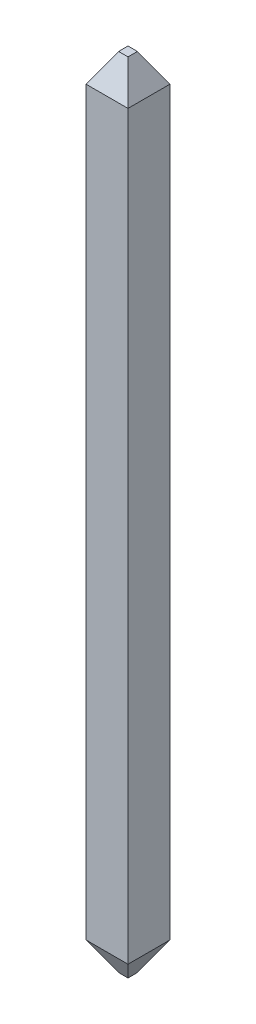
ISO-10303-21;
HEADER;
FILE_DESCRIPTION(('STEP AP214'),'2;1');
FILE_NAME('part.step','',(''),(''),'','','');
FILE_SCHEMA(('AUTOMOTIVE_DESIGN { 1 0 10303 214 1 1 1 1 }'));
ENDSEC;
DATA;
#1=APPLICATION_CONTEXT('core data for automotive mechanical design processes');
#2=APPLICATION_PROTOCOL_DEFINITION('international standard','automotive_design',2000,#1);
#3=PRODUCT_CONTEXT('',#1,'mechanical');
#4=PRODUCT('Part','Part','',(#3));
#5=PRODUCT_RELATED_PRODUCT_CATEGORY('part','',(#4));
#6=PRODUCT_DEFINITION_FORMATION('','',#4);
#7=PRODUCT_DEFINITION_CONTEXT('part definition',#1,'design');
#8=PRODUCT_DEFINITION('design','',#6,#7);
#9=PRODUCT_DEFINITION_SHAPE('','',#8);
#10=(LENGTH_UNIT() NAMED_UNIT(*) SI_UNIT(.MILLI.,.METRE.));
#11=(NAMED_UNIT(*) PLANE_ANGLE_UNIT() SI_UNIT($,.RADIAN.));
#12=(NAMED_UNIT(*) SI_UNIT($,.STERADIAN.) SOLID_ANGLE_UNIT());
#13=UNCERTAINTY_MEASURE_WITH_UNIT(LENGTH_MEASURE(1.E-05),#10,'distance_accuracy_value','');
#14=(GEOMETRIC_REPRESENTATION_CONTEXT(3) GLOBAL_UNCERTAINTY_ASSIGNED_CONTEXT((#13)) GLOBAL_UNIT_ASSIGNED_CONTEXT((#10,
#11,#12)) REPRESENTATION_CONTEXT('',''));
#15=CARTESIAN_POINT('',(0.,0.,0.));
#16=DIRECTION('',(0.,0.,1.));
#17=DIRECTION('',(1.,0.,0.));
#18=AXIS2_PLACEMENT_3D('',#15,#16,#17);
#19=CARTESIAN_POINT('',(-0.075,12.7,0.));
#20=DIRECTION('',(-0.866025403784436,0.5,0.));
#21=DIRECTION('',(0.,0.,1.));
#22=AXIS2_PLACEMENT_3D('',#19,#20,#21);
#23=PLANE('',#22);
#24=DIRECTION('',(-0.447213595499961,-0.774596669241479,0.447213595499962));
#25=VECTOR('',#24,1.);
#26=CARTESIAN_POINT('',(-0.075,12.7,0.0749999999999992));
#27=LINE('',#26,#25);
#28=CARTESIAN_POINT('',(-0.075,12.7,0.0749999999999992));
#29=VERTEX_POINT('',#28);
#30=CARTESIAN_POINT('',(-0.335,12.2496667900321,0.335));
#31=VERTEX_POINT('',#30);
#32=EDGE_CURVE('E196',#29,#31,#27,.T.);
#33=ORIENTED_EDGE('',*,*,#32,.F.);
#34=DIRECTION('',(0.,0.,1.));
#35=VECTOR('',#34,1.);
#36=CARTESIAN_POINT('',(-0.075,12.7,0.));
#37=LINE('',#36,#35);
#38=CARTESIAN_POINT('',(-0.075,12.7,-0.075));
#39=VERTEX_POINT('',#38);
#40=EDGE_CURVE('E11',#39,#29,#37,.T.);
#41=ORIENTED_EDGE('',*,*,#40,.F.);
#42=DIRECTION('',(0.447213595499962,0.774596669241479,0.447213595499962));
#43=VECTOR('',#42,1.);
#44=CARTESIAN_POINT('',(-0.335,12.2496667900321,-0.335));
#45=LINE('',#44,#43);
#46=CARTESIAN_POINT('',(-0.335,12.2496667900321,-0.335));
#47=VERTEX_POINT('',#46);
#48=EDGE_CURVE('E109',#47,#39,#45,.T.);
#49=ORIENTED_EDGE('',*,*,#48,.F.);
#50=DIRECTION('',(0.,0.,1.));
#51=VECTOR('',#50,1.);
#52=CARTESIAN_POINT('',(-0.335,12.2496667900321,-0.335));
#53=LINE('',#52,#51);
#54=EDGE_CURVE('E176',#47,#31,#53,.T.);
#55=ORIENTED_EDGE('',*,*,#54,.T.);
#56=EDGE_LOOP('',(#33,#41,#49,#55));
#57=FACE_BOUND('',#56,.T.);
#58=ADVANCED_FACE('F16',(#57),#23,.T.);
#59=CARTESIAN_POINT('',(-0.335,0.45033320996791,-0.335));
#60=DIRECTION('',(0.866025403784439,0.5,0.));
#61=DIRECTION('',(0.,0.,-1.));
#62=AXIS2_PLACEMENT_3D('',#59,#60,#61);
#63=PLANE('',#62);
#64=DIRECTION('',(0.,0.,-1.));
#65=VECTOR('',#64,1.);
#66=CARTESIAN_POINT('',(-0.335,0.45033320996791,-0.335));
#67=LINE('',#66,#65);
#68=CARTESIAN_POINT('',(-0.335,0.45033320996791,0.335));
#69=VERTEX_POINT('',#68);
#70=CARTESIAN_POINT('',(-0.335,0.45033320996791,-0.335));
#71=VERTEX_POINT('',#70);
#72=EDGE_CURVE('E117',#69,#71,#67,.T.);
#73=ORIENTED_EDGE('',*,*,#72,.T.);
#74=DIRECTION('',(0.447213595499958,-0.774596669241484,0.447213595499957));
#75=VECTOR('',#74,1.);
#76=CARTESIAN_POINT('',(-0.335,0.45033320996791,-0.335));
#77=LINE('',#76,#75);
#78=CARTESIAN_POINT('',(-0.075,0.,-0.075));
#79=VERTEX_POINT('',#78);
#80=EDGE_CURVE('E190',#71,#79,#77,.T.);
#81=ORIENTED_EDGE('',*,*,#80,.T.);
#82=DIRECTION('',(0.,0.,1.));
#83=VECTOR('',#82,1.);
#84=CARTESIAN_POINT('',(-0.075,0.,0.));
#85=LINE('',#84,#83);
#86=CARTESIAN_POINT('',(-0.075,0.,0.0749999999999992));
#87=VERTEX_POINT('',#86);
#88=EDGE_CURVE('E192',#79,#87,#85,.T.);
#89=ORIENTED_EDGE('',*,*,#88,.T.);
#90=DIRECTION('',(-0.447213595499957,0.774596669241484,0.447213595499957));
#91=VECTOR('',#90,1.);
#92=CARTESIAN_POINT('',(-0.075,0.,0.0749999999999992));
#93=LINE('',#92,#91);
#94=EDGE_CURVE('E136',#87,#69,#93,.T.);
#95=ORIENTED_EDGE('',*,*,#94,.T.);
#96=EDGE_LOOP('',(#73,#81,#89,#95));
#97=FACE_BOUND('',#96,.T.);
#98=ADVANCED_FACE('F238',(#97),#63,.F.);
#99=CARTESIAN_POINT('',(0.,12.7,0.));
#100=DIRECTION('',(0.,1.,0.));
#101=DIRECTION('',(1.,0.,0.));
#102=AXIS2_PLACEMENT_3D('',#99,#100,#101);
#103=PLANE('',#102);
#104=DIRECTION('',(0.,0.,1.));
#105=VECTOR('',#104,1.);
#106=CARTESIAN_POINT('',(0.075,12.7,0.));
#107=LINE('',#106,#105);
#108=CARTESIAN_POINT('',(0.075,12.7,-0.075));
#109=VERTEX_POINT('',#108);
#110=CARTESIAN_POINT('',(0.075,12.7,0.0749999999999992));
#111=VERTEX_POINT('',#110);
#112=EDGE_CURVE('E113',#109,#111,#107,.T.);
#113=ORIENTED_EDGE('',*,*,#112,.F.);
#114=DIRECTION('',(1.,0.,0.));
#115=VECTOR('',#114,1.);
#116=CARTESIAN_POINT('',(0.,12.7,-0.075));
#117=LINE('',#116,#115);
#118=EDGE_CURVE('E26',#39,#109,#117,.T.);
#119=ORIENTED_EDGE('',*,*,#118,.F.);
#120=ORIENTED_EDGE('',*,*,#40,.T.);
#121=DIRECTION('',(-1.,0.,0.));
#122=VECTOR('',#121,1.);
#123=CARTESIAN_POINT('',(0.,12.7,0.0749999999999992));
#124=LINE('',#123,#122);
#125=EDGE_CURVE('E115',#111,#29,#124,.T.);
#126=ORIENTED_EDGE('',*,*,#125,.F.);
#127=EDGE_LOOP('',(#113,#119,#120,#126));
#128=FACE_BOUND('',#127,.T.);
#129=ADVANCED_FACE('F18',(#128),#103,.T.);
#130=CARTESIAN_POINT('',(0.,12.7,-0.075));
#131=DIRECTION('',(0.,0.5,-0.866025403784436));
#132=DIRECTION('',(-1.,0.,0.));
#133=AXIS2_PLACEMENT_3D('',#130,#131,#132);
#134=PLANE('',#133);
#135=ORIENTED_EDGE('',*,*,#48,.T.);
#136=ORIENTED_EDGE('',*,*,#118,.T.);
#137=DIRECTION('',(-0.447213595499962,0.774596669241479,0.447213595499962));
#138=VECTOR('',#137,1.);
#139=CARTESIAN_POINT('',(0.335,12.2496667900321,-0.335));
#140=LINE('',#139,#138);
#141=CARTESIAN_POINT('',(0.335,12.2496667900321,-0.335));
#142=VERTEX_POINT('',#141);
#143=EDGE_CURVE('E101',#142,#109,#140,.T.);
#144=ORIENTED_EDGE('',*,*,#143,.F.);
#145=DIRECTION('',(-1.,0.,0.));
#146=VECTOR('',#145,1.);
#147=CARTESIAN_POINT('',(-0.335,12.2496667900321,-0.335));
#148=LINE('',#147,#146);
#149=EDGE_CURVE('E130',#142,#47,#148,.T.);
#150=ORIENTED_EDGE('',*,*,#149,.T.);
#151=EDGE_LOOP('',(#135,#136,#144,#150));
#152=FACE_BOUND('',#151,.T.);
#153=ADVANCED_FACE('F108',(#152),#134,.T.);
#154=CARTESIAN_POINT('',(-0.335,0.45033320996791,-0.335));
#155=DIRECTION('',(0.,0.5,0.866025403784439));
#156=DIRECTION('',(1.,0.,0.));
#157=AXIS2_PLACEMENT_3D('',#154,#155,#156);
#158=PLANE('',#157);
#159=DIRECTION('',(-1.,0.,0.));
#160=VECTOR('',#159,1.);
#161=CARTESIAN_POINT('',(0.,0.,-0.075));
#162=LINE('',#161,#160);
#163=CARTESIAN_POINT('',(0.075,0.,-0.075));
#164=VERTEX_POINT('',#163);
#165=EDGE_CURVE('E199',#164,#79,#162,.T.);
#166=ORIENTED_EDGE('',*,*,#165,.T.);
#167=ORIENTED_EDGE('',*,*,#80,.F.);
#168=DIRECTION('',(1.,0.,0.));
#169=VECTOR('',#168,1.);
#170=CARTESIAN_POINT('',(-0.335,0.45033320996791,-0.335));
#171=LINE('',#170,#169);
#172=CARTESIAN_POINT('',(0.335,0.45033320996791,-0.335));
#173=VERTEX_POINT('',#172);
#174=EDGE_CURVE('E189',#71,#173,#171,.T.);
#175=ORIENTED_EDGE('',*,*,#174,.T.);
#176=DIRECTION('',(-0.447213595499957,-0.774596669241484,0.447213595499957));
#177=VECTOR('',#176,1.);
#178=CARTESIAN_POINT('',(0.335,0.45033320996791,-0.335));
#179=LINE('',#178,#177);
#180=EDGE_CURVE('E148',#173,#164,#179,.T.);
#181=ORIENTED_EDGE('',*,*,#180,.T.);
#182=EDGE_LOOP('',(#166,#167,#175,#181));
#183=FACE_BOUND('',#182,.T.);
#184=ADVANCED_FACE('F235',(#183),#158,.F.);
#185=CARTESIAN_POINT('',(0.,0.,0.));
#186=DIRECTION('',(0.,1.,0.));
#187=DIRECTION('',(1.,0.,0.));
#188=AXIS2_PLACEMENT_3D('',#185,#186,#187);
#189=PLANE('',#188);
#190=ORIENTED_EDGE('',*,*,#165,.F.);
#191=DIRECTION('',(0.,0.,1.));
#192=VECTOR('',#191,1.);
#193=CARTESIAN_POINT('',(0.0749999999999992,0.,-0.335));
#194=LINE('',#193,#192);
#195=CARTESIAN_POINT('',(0.075,0.,0.0749999999999992));
#196=VERTEX_POINT('',#195);
#197=EDGE_CURVE('E146',#164,#196,#194,.T.);
#198=ORIENTED_EDGE('',*,*,#197,.T.);
#199=DIRECTION('',(-1.,0.,0.));
#200=VECTOR('',#199,1.);
#201=CARTESIAN_POINT('',(-0.335,0.,0.0749999999999992));
#202=LINE('',#201,#200);
#203=EDGE_CURVE('E138',#196,#87,#202,.T.);
#204=ORIENTED_EDGE('',*,*,#203,.T.);
#205=ORIENTED_EDGE('',*,*,#88,.F.);
#206=EDGE_LOOP('',(#190,#198,#204,#205));
#207=FACE_BOUND('',#206,.T.);
#208=ADVANCED_FACE('F209',(#207),#189,.F.);
#209=CARTESIAN_POINT('',(0.,12.7,0.0749999999999992));
#210=DIRECTION('',(0.,0.5,0.866025403784436));
#211=DIRECTION('',(1.,0.,0.));
#212=AXIS2_PLACEMENT_3D('',#209,#210,#211);
#213=PLANE('',#212);
#214=DIRECTION('',(0.447213595499962,-0.774596669241479,0.447213595499962));
#215=VECTOR('',#214,1.);
#216=CARTESIAN_POINT('',(0.075,12.7,0.0749999999999992));
#217=LINE('',#216,#215);
#218=CARTESIAN_POINT('',(0.335,12.2496667900321,0.335));
#219=VERTEX_POINT('',#218);
#220=EDGE_CURVE('E86',#111,#219,#217,.T.);
#221=ORIENTED_EDGE('',*,*,#220,.F.);
#222=ORIENTED_EDGE('',*,*,#125,.T.);
#223=ORIENTED_EDGE('',*,*,#32,.T.);
#224=DIRECTION('',(1.,0.,0.));
#225=VECTOR('',#224,1.);
#226=CARTESIAN_POINT('',(-0.335,12.2496667900321,0.335));
#227=LINE('',#226,#225);
#228=EDGE_CURVE('E139',#31,#219,#227,.T.);
#229=ORIENTED_EDGE('',*,*,#228,.T.);
#230=EDGE_LOOP('',(#221,#222,#223,#229));
#231=FACE_BOUND('',#230,.T.);
#232=ADVANCED_FACE('F299',(#231),#213,.T.);
#233=CARTESIAN_POINT('',(-0.335,0.45033320996791,0.335));
#234=DIRECTION('',(0.,0.5,-0.866025403784439));
#235=DIRECTION('',(-1.,0.,0.));
#236=AXIS2_PLACEMENT_3D('',#233,#234,#235);
#237=PLANE('',#236);
#238=ORIENTED_EDGE('',*,*,#203,.F.);
#239=DIRECTION('',(0.447213595499958,0.774596669241484,0.447213595499957));
#240=VECTOR('',#239,1.);
#241=CARTESIAN_POINT('',(0.075,0.,0.0749999999999992));
#242=LINE('',#241,#240);
#243=CARTESIAN_POINT('',(0.335,0.45033320996791,0.335));
#244=VERTEX_POINT('',#243);
#245=EDGE_CURVE('E151',#196,#244,#242,.T.);
#246=ORIENTED_EDGE('',*,*,#245,.T.);
#247=DIRECTION('',(-1.,0.,0.));
#248=VECTOR('',#247,1.);
#249=CARTESIAN_POINT('',(-0.335,0.45033320996791,0.335));
#250=LINE('',#249,#248);
#251=EDGE_CURVE('E143',#244,#69,#250,.T.);
#252=ORIENTED_EDGE('',*,*,#251,.T.);
#253=ORIENTED_EDGE('',*,*,#94,.F.);
#254=EDGE_LOOP('',(#238,#246,#252,#253));
#255=FACE_BOUND('',#254,.T.);
#256=ADVANCED_FACE('F215',(#255),#237,.F.);
#257=CARTESIAN_POINT('',(-0.335,12.7,-0.335));
#258=DIRECTION('',(1.,0.,0.));
#259=DIRECTION('',(0.,0.,-1.));
#260=AXIS2_PLACEMENT_3D('',#257,#258,#259);
#261=PLANE('',#260);
#262=ORIENTED_EDGE('',*,*,#72,.F.);
#263=DIRECTION('',(0.,1.,0.));
#264=VECTOR('',#263,1.);
#265=CARTESIAN_POINT('',(-0.335,12.7,0.335));
#266=LINE('',#265,#264);
#267=EDGE_CURVE('E142',#69,#31,#266,.T.);
#268=ORIENTED_EDGE('',*,*,#267,.T.);
#269=ORIENTED_EDGE('',*,*,#54,.F.);
#270=DIRECTION('',(0.,-1.,0.));
#271=VECTOR('',#270,1.);
#272=CARTESIAN_POINT('',(-0.335,12.7,-0.335));
#273=LINE('',#272,#271);
#274=EDGE_CURVE('E134',#47,#71,#273,.T.);
#275=ORIENTED_EDGE('',*,*,#274,.T.);
#276=EDGE_LOOP('',(#262,#268,#269,#275));
#277=FACE_BOUND('',#276,.T.);
#278=ADVANCED_FACE('F241',(#277),#261,.F.);
#279=CARTESIAN_POINT('',(0.075,12.7,0.));
#280=DIRECTION('',(0.866025403784436,0.5,0.));
#281=DIRECTION('',(0.,0.,-1.));
#282=AXIS2_PLACEMENT_3D('',#279,#280,#281);
#283=PLANE('',#282);
#284=ORIENTED_EDGE('',*,*,#220,.T.);
#285=DIRECTION('',(0.,0.,-1.));
#286=VECTOR('',#285,1.);
#287=CARTESIAN_POINT('',(0.335,12.2496667900321,-0.335));
#288=LINE('',#287,#286);
#289=EDGE_CURVE('E121',#219,#142,#288,.T.);
#290=ORIENTED_EDGE('',*,*,#289,.T.);
#291=ORIENTED_EDGE('',*,*,#143,.T.);
#292=ORIENTED_EDGE('',*,*,#112,.T.);
#293=EDGE_LOOP('',(#284,#290,#291,#292));
#294=FACE_BOUND('',#293,.T.);
#295=ADVANCED_FACE('F119',(#294),#283,.T.);
#296=CARTESIAN_POINT('',(-0.335,12.7,-0.335));
#297=DIRECTION('',(0.,0.,1.));
#298=DIRECTION('',(1.,0.,0.));
#299=AXIS2_PLACEMENT_3D('',#296,#297,#298);
#300=PLANE('',#299);
#301=ORIENTED_EDGE('',*,*,#174,.F.);
#302=ORIENTED_EDGE('',*,*,#274,.F.);
#303=ORIENTED_EDGE('',*,*,#149,.F.);
#304=DIRECTION('',(0.,-1.,0.));
#305=VECTOR('',#304,1.);
#306=CARTESIAN_POINT('',(0.335,12.7,-0.335));
#307=LINE('',#306,#305);
#308=EDGE_CURVE('E165',#142,#173,#307,.T.);
#309=ORIENTED_EDGE('',*,*,#308,.T.);
#310=EDGE_LOOP('',(#301,#302,#303,#309));
#311=FACE_BOUND('',#310,.T.);
#312=ADVANCED_FACE('F224',(#311),#300,.F.);
#313=CARTESIAN_POINT('',(0.335,0.45033320996791,-0.335));
#314=DIRECTION('',(-0.866025403784439,0.5,0.));
#315=DIRECTION('',(0.,0.,1.));
#316=AXIS2_PLACEMENT_3D('',#313,#314,#315);
#317=PLANE('',#316);
#318=ORIENTED_EDGE('',*,*,#197,.F.);
#319=ORIENTED_EDGE('',*,*,#180,.F.);
#320=DIRECTION('',(0.,0.,1.));
#321=VECTOR('',#320,1.);
#322=CARTESIAN_POINT('',(0.335,0.45033320996791,-0.335));
#323=LINE('',#322,#321);
#324=EDGE_CURVE('E172',#173,#244,#323,.T.);
#325=ORIENTED_EDGE('',*,*,#324,.T.);
#326=ORIENTED_EDGE('',*,*,#245,.F.);
#327=EDGE_LOOP('',(#318,#319,#325,#326));
#328=FACE_BOUND('',#327,.T.);
#329=ADVANCED_FACE('F217',(#328),#317,.F.);
#330=CARTESIAN_POINT('',(-0.335,12.7,0.335));
#331=DIRECTION('',(0.,0.,-1.));
#332=DIRECTION('',(0.,-1.,0.));
#333=AXIS2_PLACEMENT_3D('',#330,#331,#332);
#334=PLANE('',#333);
#335=ORIENTED_EDGE('',*,*,#251,.F.);
#336=DIRECTION('',(0.,1.,0.));
#337=VECTOR('',#336,1.);
#338=CARTESIAN_POINT('',(0.335,12.7,0.335));
#339=LINE('',#338,#337);
#340=EDGE_CURVE('E152',#244,#219,#339,.T.);
#341=ORIENTED_EDGE('',*,*,#340,.T.);
#342=ORIENTED_EDGE('',*,*,#228,.F.);
#343=ORIENTED_EDGE('',*,*,#267,.F.);
#344=EDGE_LOOP('',(#335,#341,#342,#343));
#345=FACE_BOUND('',#344,.T.);
#346=ADVANCED_FACE('F351',(#345),#334,.F.);
#347=CARTESIAN_POINT('',(0.335,12.7,-0.335));
#348=DIRECTION('',(-1.,0.,0.));
#349=DIRECTION('',(0.,1.,0.));
#350=AXIS2_PLACEMENT_3D('',#347,#348,#349);
#351=PLANE('',#350);
#352=ORIENTED_EDGE('',*,*,#324,.F.);
#353=ORIENTED_EDGE('',*,*,#308,.F.);
#354=ORIENTED_EDGE('',*,*,#289,.F.);
#355=ORIENTED_EDGE('',*,*,#340,.F.);
#356=EDGE_LOOP('',(#352,#353,#354,#355));
#357=FACE_BOUND('',#356,.T.);
#358=ADVANCED_FACE('F221',(#357),#351,.F.);
#359=CLOSED_SHELL('',(#58,#98,#129,#153,#184,#208,#232,#256,#278,#295,#312,#329,#346,#358));
#360=MANIFOLD_SOLID_BREP('B1',#359);
#361=ADVANCED_BREP_SHAPE_REPRESENTATION('',(#18,#360),#14);
#362=SHAPE_DEFINITION_REPRESENTATION(#9,#361);
ENDSEC;
END-ISO-10303-21;
